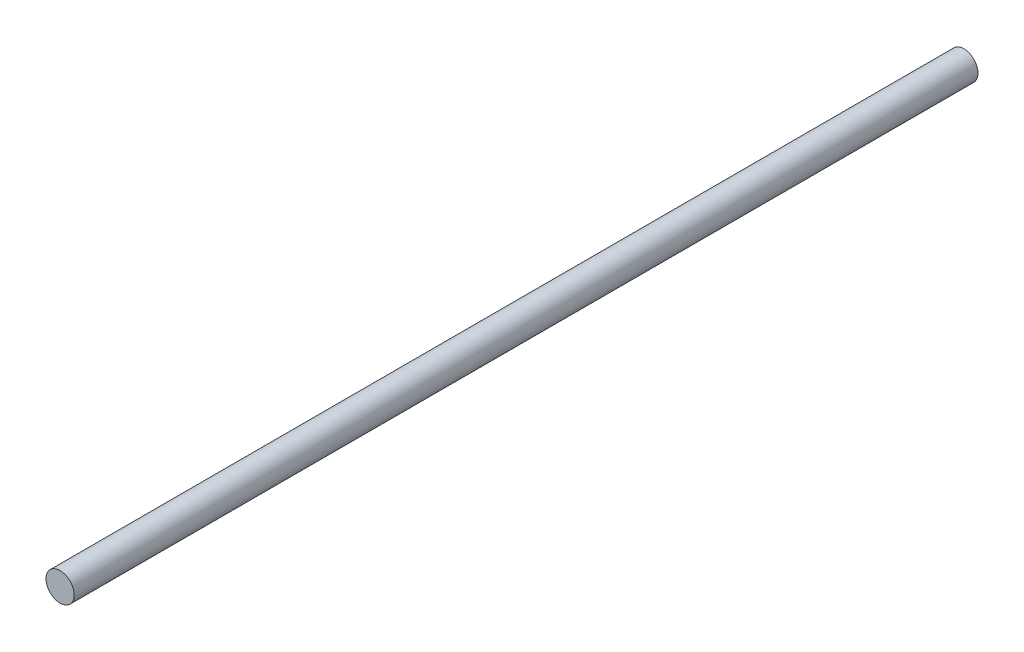
ISO-10303-21;
HEADER;
FILE_DESCRIPTION(('STEP AP214'),'2;1');
FILE_NAME('part.step','',(''),(''),'','','');
FILE_SCHEMA(('AUTOMOTIVE_DESIGN { 1 0 10303 214 1 1 1 1 }'));
ENDSEC;
DATA;
#1=APPLICATION_CONTEXT('core data for automotive mechanical design processes');
#2=APPLICATION_PROTOCOL_DEFINITION('international standard','automotive_design',2000,#1);
#3=PRODUCT_CONTEXT('',#1,'mechanical');
#4=PRODUCT('Part','Part','',(#3));
#5=PRODUCT_RELATED_PRODUCT_CATEGORY('part','',(#4));
#6=PRODUCT_DEFINITION_FORMATION('','',#4);
#7=PRODUCT_DEFINITION_CONTEXT('part definition',#1,'design');
#8=PRODUCT_DEFINITION('design','',#6,#7);
#9=PRODUCT_DEFINITION_SHAPE('','',#8);
#10=(LENGTH_UNIT() NAMED_UNIT(*) SI_UNIT(.MILLI.,.METRE.));
#11=(NAMED_UNIT(*) PLANE_ANGLE_UNIT() SI_UNIT($,.RADIAN.));
#12=(NAMED_UNIT(*) SI_UNIT($,.STERADIAN.) SOLID_ANGLE_UNIT());
#13=UNCERTAINTY_MEASURE_WITH_UNIT(LENGTH_MEASURE(1.E-05),#10,'distance_accuracy_value','');
#14=(GEOMETRIC_REPRESENTATION_CONTEXT(3) GLOBAL_UNCERTAINTY_ASSIGNED_CONTEXT((#13)) GLOBAL_UNIT_ASSIGNED_CONTEXT((#10,
#11,#12)) REPRESENTATION_CONTEXT('',''));
#15=CARTESIAN_POINT('',(0.,0.,0.));
#16=DIRECTION('',(0.,0.,1.));
#17=DIRECTION('',(1.,0.,0.));
#18=AXIS2_PLACEMENT_3D('',#15,#16,#17);
#19=CARTESIAN_POINT('',(0.,0.,203.2));
#20=DIRECTION('',(0.,0.,-1.));
#21=DIRECTION('',(-1.,0.,0.));
#22=AXIS2_PLACEMENT_3D('',#19,#20,#21);
#23=CYLINDRICAL_SURFACE('',#22,3.175);
#24=CARTESIAN_POINT('',(0.,0.,203.2));
#25=DIRECTION('',(0.,0.,1.));
#26=DIRECTION('',(1.,0.,0.));
#27=AXIS2_PLACEMENT_3D('',#24,#25,#26);
#28=CIRCLE('',#27,3.175);
#29=CARTESIAN_POINT('',(3.175,0.,203.2));
#30=VERTEX_POINT('',#29);
#31=EDGE_CURVE('E10',#30,#30,#28,.T.);
#32=ORIENTED_EDGE('',*,*,#31,.F.);
#33=EDGE_LOOP('',(#32));
#34=FACE_BOUND('',#33,.T.);
#35=CARTESIAN_POINT('',(0.,0.,0.));
#36=DIRECTION('',(0.,0.,1.));
#37=DIRECTION('',(1.,0.,0.));
#38=AXIS2_PLACEMENT_3D('',#35,#36,#37);
#39=CIRCLE('',#38,3.175);
#40=CARTESIAN_POINT('',(3.175,0.,0.));
#41=VERTEX_POINT('',#40);
#42=EDGE_CURVE('E33',#41,#41,#39,.T.);
#43=ORIENTED_EDGE('',*,*,#42,.T.);
#44=EDGE_LOOP('',(#43));
#45=FACE_BOUND('',#44,.T.);
#46=ADVANCED_FACE('F30',(#34,#45),#23,.T.);
#47=CARTESIAN_POINT('',(0.,0.,203.2));
#48=DIRECTION('',(0.,0.,1.));
#49=DIRECTION('',(1.,0.,0.));
#50=AXIS2_PLACEMENT_3D('',#47,#48,#49);
#51=PLANE('',#50);
#52=ORIENTED_EDGE('',*,*,#31,.T.);
#53=EDGE_LOOP('',(#52));
#54=FACE_BOUND('',#53,.T.);
#55=ADVANCED_FACE('F45',(#54),#51,.T.);
#56=CARTESIAN_POINT('',(0.,0.,0.));
#57=DIRECTION('',(0.,0.,1.));
#58=DIRECTION('',(1.,0.,0.));
#59=AXIS2_PLACEMENT_3D('',#56,#57,#58);
#60=PLANE('',#59);
#61=ORIENTED_EDGE('',*,*,#42,.F.);
#62=EDGE_LOOP('',(#61));
#63=FACE_BOUND('',#62,.T.);
#64=ADVANCED_FACE('F43',(#63),#60,.F.);
#65=CLOSED_SHELL('',(#46,#55,#64));
#66=MANIFOLD_SOLID_BREP('B2',#65);
#67=ADVANCED_BREP_SHAPE_REPRESENTATION('',(#18,#66),#14);
#68=SHAPE_DEFINITION_REPRESENTATION(#9,#67);
ENDSEC;
END-ISO-10303-21;
